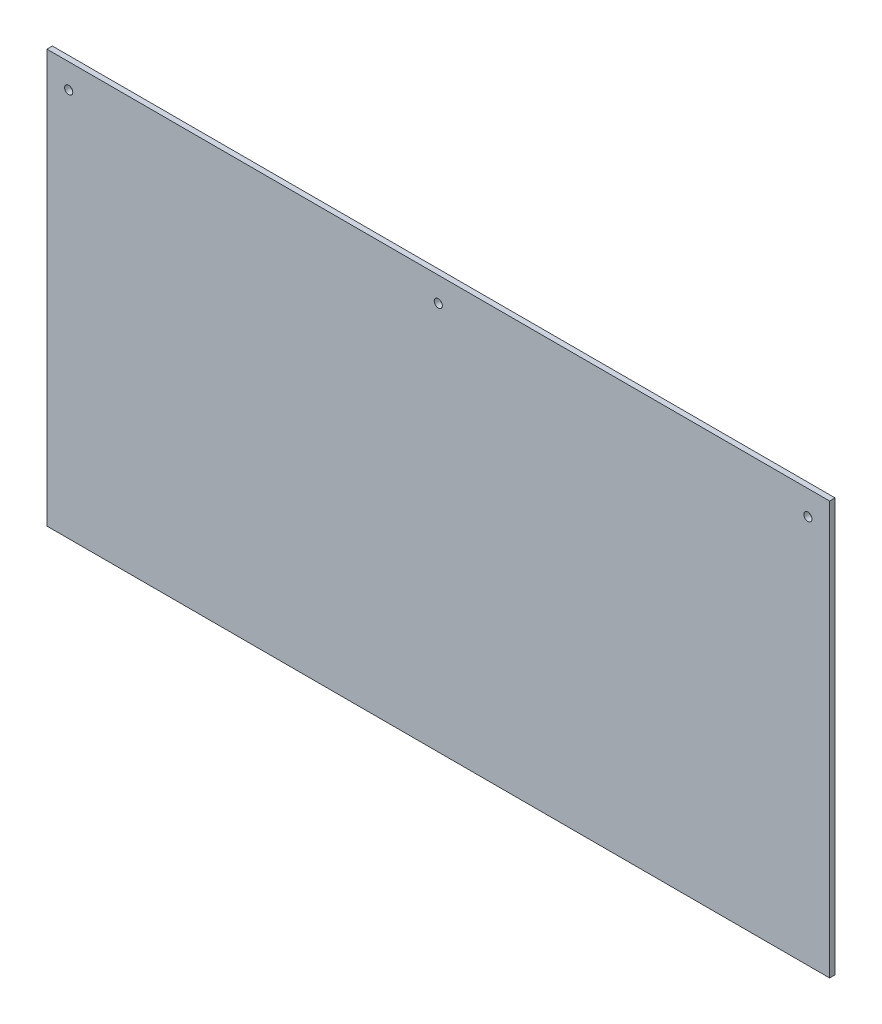
ISO-10303-21;
HEADER;
FILE_DESCRIPTION(('STEP AP214'),'2;1');
FILE_NAME('part.step','',(''),(''),'','','');
FILE_SCHEMA(('AUTOMOTIVE_DESIGN { 1 0 10303 214 1 1 1 1 }'));
ENDSEC;
DATA;
#1=APPLICATION_CONTEXT('core data for automotive mechanical design processes');
#2=APPLICATION_PROTOCOL_DEFINITION('international standard','automotive_design',2000,#1);
#3=PRODUCT_CONTEXT('',#1,'mechanical');
#4=PRODUCT('Part','Part','',(#3));
#5=PRODUCT_RELATED_PRODUCT_CATEGORY('part','',(#4));
#6=PRODUCT_DEFINITION_FORMATION('','',#4);
#7=PRODUCT_DEFINITION_CONTEXT('part definition',#1,'design');
#8=PRODUCT_DEFINITION('design','',#6,#7);
#9=PRODUCT_DEFINITION_SHAPE('','',#8);
#10=(LENGTH_UNIT() NAMED_UNIT(*) SI_UNIT(.MILLI.,.METRE.));
#11=(NAMED_UNIT(*) PLANE_ANGLE_UNIT() SI_UNIT($,.RADIAN.));
#12=(NAMED_UNIT(*) SI_UNIT($,.STERADIAN.) SOLID_ANGLE_UNIT());
#13=UNCERTAINTY_MEASURE_WITH_UNIT(LENGTH_MEASURE(1.E-05),#10,'distance_accuracy_value','');
#14=(GEOMETRIC_REPRESENTATION_CONTEXT(3) GLOBAL_UNCERTAINTY_ASSIGNED_CONTEXT((#13)) GLOBAL_UNIT_ASSIGNED_CONTEXT((#10,
#11,#12)) REPRESENTATION_CONTEXT('',''));
#15=CARTESIAN_POINT('',(0.,0.,0.));
#16=DIRECTION('',(0.,0.,1.));
#17=DIRECTION('',(1.,0.,0.));
#18=AXIS2_PLACEMENT_3D('',#15,#16,#17);
#19=CARTESIAN_POINT('',(0.,0.,6.35));
#20=DIRECTION('',(0.,0.,1.));
#21=DIRECTION('',(1.,0.,0.));
#22=AXIS2_PLACEMENT_3D('',#19,#20,#21);
#23=PLANE('',#22);
#24=CARTESIAN_POINT('',(889.,454.025,6.35));
#25=DIRECTION('',(0.,0.,1.));
#26=DIRECTION('',(1.,0.,0.));
#27=AXIS2_PLACEMENT_3D('',#24,#25,#26);
#28=CIRCLE('',#27,4.7625);
#29=CARTESIAN_POINT('',(893.7625,454.025,6.35));
#30=VERTEX_POINT('',#29);
#31=EDGE_CURVE('E89',#30,#30,#28,.F.);
#32=ORIENTED_EDGE('',*,*,#31,.T.);
#33=EDGE_LOOP('',(#32));
#34=FACE_BOUND('',#33,.T.);
#35=CARTESIAN_POINT('',(457.2,454.025,6.35));
#36=DIRECTION('',(0.,0.,1.));
#37=DIRECTION('',(1.,0.,0.));
#38=AXIS2_PLACEMENT_3D('',#35,#36,#37);
#39=CIRCLE('',#38,4.7625);
#40=CARTESIAN_POINT('',(461.9625,454.025,6.35));
#41=VERTEX_POINT('',#40);
#42=EDGE_CURVE('E91',#41,#41,#39,.F.);
#43=ORIENTED_EDGE('',*,*,#42,.T.);
#44=EDGE_LOOP('',(#43));
#45=FACE_BOUND('',#44,.T.);
#46=CARTESIAN_POINT('',(25.4,454.025,6.35));
#47=DIRECTION('',(0.,0.,1.));
#48=DIRECTION('',(1.,0.,0.));
#49=AXIS2_PLACEMENT_3D('',#46,#47,#48);
#50=CIRCLE('',#49,4.7625);
#51=CARTESIAN_POINT('',(30.1625,454.025,6.35));
#52=VERTEX_POINT('',#51);
#53=EDGE_CURVE('E20',#52,#52,#50,.F.);
#54=ORIENTED_EDGE('',*,*,#53,.T.);
#55=EDGE_LOOP('',(#54));
#56=FACE_BOUND('',#55,.T.);
#57=DIRECTION('',(0.,1.,0.));
#58=VECTOR('',#57,1.);
#59=CARTESIAN_POINT('',(0.,482.6,6.35));
#60=LINE('',#59,#58);
#61=CARTESIAN_POINT('',(0.,0.,6.35));
#62=VERTEX_POINT('',#61);
#63=CARTESIAN_POINT('',(0.,482.6,6.35));
#64=VERTEX_POINT('',#63);
#65=EDGE_CURVE('E71',#62,#64,#60,.T.);
#66=ORIENTED_EDGE('',*,*,#65,.F.);
#67=DIRECTION('',(1.,0.,0.));
#68=VECTOR('',#67,1.);
#69=CARTESIAN_POINT('',(0.,0.,6.35));
#70=LINE('',#69,#68);
#71=CARTESIAN_POINT('',(914.4,0.,6.35));
#72=VERTEX_POINT('',#71);
#73=EDGE_CURVE('E68',#72,#62,#70,.F.);
#74=ORIENTED_EDGE('',*,*,#73,.F.);
#75=DIRECTION('',(0.,1.,0.));
#76=VECTOR('',#75,1.);
#77=CARTESIAN_POINT('',(914.4,0.,6.35));
#78=LINE('',#77,#76);
#79=CARTESIAN_POINT('',(914.4,482.6,6.35));
#80=VERTEX_POINT('',#79);
#81=EDGE_CURVE('E59',#80,#72,#78,.F.);
#82=ORIENTED_EDGE('',*,*,#81,.F.);
#83=DIRECTION('',(1.,0.,0.));
#84=VECTOR('',#83,1.);
#85=CARTESIAN_POINT('',(914.4,482.6,6.35));
#86=LINE('',#85,#84);
#87=EDGE_CURVE('E54',#64,#80,#86,.T.);
#88=ORIENTED_EDGE('',*,*,#87,.F.);
#89=EDGE_LOOP('',(#66,#74,#82,#88));
#90=FACE_BOUND('',#89,.T.);
#91=ADVANCED_FACE('F17',(#34,#45,#56,#90),#23,.T.);
#92=CARTESIAN_POINT('',(0.,0.,0.));
#93=DIRECTION('',(0.,-1.,0.));
#94=DIRECTION('',(0.,0.,-1.));
#95=AXIS2_PLACEMENT_3D('',#92,#93,#94);
#96=PLANE('',#95);
#97=DIRECTION('',(0.,0.,1.));
#98=VECTOR('',#97,1.);
#99=CARTESIAN_POINT('',(0.,0.,0.));
#100=LINE('',#99,#98);
#101=CARTESIAN_POINT('',(0.,0.,0.));
#102=VERTEX_POINT('',#101);
#103=EDGE_CURVE('E99',#102,#62,#100,.T.);
#104=ORIENTED_EDGE('',*,*,#103,.F.);
#105=DIRECTION('',(1.,0.,0.));
#106=VECTOR('',#105,1.);
#107=CARTESIAN_POINT('',(0.,0.,0.));
#108=LINE('',#107,#106);
#109=CARTESIAN_POINT('',(914.4,0.,0.));
#110=VERTEX_POINT('',#109);
#111=EDGE_CURVE('E78',#102,#110,#108,.T.);
#112=ORIENTED_EDGE('',*,*,#111,.T.);
#113=DIRECTION('',(0.,0.,-1.));
#114=VECTOR('',#113,1.);
#115=CARTESIAN_POINT('',(914.4,0.,0.));
#116=LINE('',#115,#114);
#117=EDGE_CURVE('E64',#72,#110,#116,.T.);
#118=ORIENTED_EDGE('',*,*,#117,.F.);
#119=ORIENTED_EDGE('',*,*,#73,.T.);
#120=EDGE_LOOP('',(#104,#112,#118,#119));
#121=FACE_BOUND('',#120,.T.);
#122=ADVANCED_FACE('F77',(#121),#96,.T.);
#123=CARTESIAN_POINT('',(914.4,0.,0.));
#124=DIRECTION('',(1.,0.,0.));
#125=DIRECTION('',(0.,0.,-1.));
#126=AXIS2_PLACEMENT_3D('',#123,#124,#125);
#127=PLANE('',#126);
#128=ORIENTED_EDGE('',*,*,#117,.T.);
#129=DIRECTION('',(0.,1.,0.));
#130=VECTOR('',#129,1.);
#131=CARTESIAN_POINT('',(914.4,0.,0.));
#132=LINE('',#131,#130);
#133=CARTESIAN_POINT('',(914.4,482.6,0.));
#134=VERTEX_POINT('',#133);
#135=EDGE_CURVE('E110',#110,#134,#132,.T.);
#136=ORIENTED_EDGE('',*,*,#135,.T.);
#137=DIRECTION('',(0.,0.,1.));
#138=VECTOR('',#137,1.);
#139=CARTESIAN_POINT('',(914.4,482.6,0.));
#140=LINE('',#139,#138);
#141=EDGE_CURVE('E66',#80,#134,#140,.F.);
#142=ORIENTED_EDGE('',*,*,#141,.F.);
#143=ORIENTED_EDGE('',*,*,#81,.T.);
#144=EDGE_LOOP('',(#128,#136,#142,#143));
#145=FACE_BOUND('',#144,.T.);
#146=ADVANCED_FACE('F61',(#145),#127,.T.);
#147=CARTESIAN_POINT('',(914.4,482.6,0.));
#148=DIRECTION('',(0.,1.,0.));
#149=DIRECTION('',(0.,0.,1.));
#150=AXIS2_PLACEMENT_3D('',#147,#148,#149);
#151=PLANE('',#150);
#152=ORIENTED_EDGE('',*,*,#141,.T.);
#153=DIRECTION('',(1.,0.,0.));
#154=VECTOR('',#153,1.);
#155=CARTESIAN_POINT('',(0.,482.6,0.));
#156=LINE('',#155,#154);
#157=CARTESIAN_POINT('',(0.,482.6,0.));
#158=VERTEX_POINT('',#157);
#159=EDGE_CURVE('E107',#134,#158,#156,.F.);
#160=ORIENTED_EDGE('',*,*,#159,.T.);
#161=DIRECTION('',(0.,0.,1.));
#162=VECTOR('',#161,1.);
#163=CARTESIAN_POINT('',(0.,482.6,0.));
#164=LINE('',#163,#162);
#165=EDGE_CURVE('E35',#64,#158,#164,.F.);
#166=ORIENTED_EDGE('',*,*,#165,.F.);
#167=ORIENTED_EDGE('',*,*,#87,.T.);
#168=EDGE_LOOP('',(#152,#160,#166,#167));
#169=FACE_BOUND('',#168,.T.);
#170=ADVANCED_FACE('F106',(#169),#151,.T.);
#171=CARTESIAN_POINT('',(0.,482.6,0.));
#172=DIRECTION('',(-1.,0.,0.));
#173=DIRECTION('',(0.,0.,1.));
#174=AXIS2_PLACEMENT_3D('',#171,#172,#173);
#175=PLANE('',#174);
#176=ORIENTED_EDGE('',*,*,#165,.T.);
#177=DIRECTION('',(0.,1.,0.));
#178=VECTOR('',#177,1.);
#179=CARTESIAN_POINT('',(0.,0.,0.));
#180=LINE('',#179,#178);
#181=EDGE_CURVE('E88',#158,#102,#180,.F.);
#182=ORIENTED_EDGE('',*,*,#181,.T.);
#183=ORIENTED_EDGE('',*,*,#103,.T.);
#184=ORIENTED_EDGE('',*,*,#65,.T.);
#185=EDGE_LOOP('',(#176,#182,#183,#184));
#186=FACE_BOUND('',#185,.T.);
#187=ADVANCED_FACE('F113',(#186),#175,.T.);
#188=CARTESIAN_POINT('',(25.4,454.025,0.));
#189=DIRECTION('',(0.,0.,1.));
#190=DIRECTION('',(1.,0.,0.));
#191=AXIS2_PLACEMENT_3D('',#188,#189,#190);
#192=CYLINDRICAL_SURFACE('',#191,4.7625);
#193=ORIENTED_EDGE('',*,*,#53,.F.);
#194=EDGE_LOOP('',(#193));
#195=FACE_BOUND('',#194,.T.);
#196=CARTESIAN_POINT('',(25.4,454.025,0.));
#197=DIRECTION('',(0.,0.,1.));
#198=DIRECTION('',(1.,0.,0.));
#199=AXIS2_PLACEMENT_3D('',#196,#197,#198);
#200=CIRCLE('',#199,4.7625);
#201=CARTESIAN_POINT('',(30.1625,454.025,0.));
#202=VERTEX_POINT('',#201);
#203=EDGE_CURVE('E85',#202,#202,#200,.F.);
#204=ORIENTED_EDGE('',*,*,#203,.T.);
#205=EDGE_LOOP('',(#204));
#206=FACE_BOUND('',#205,.T.);
#207=ADVANCED_FACE('F115',(#195,#206),#192,.F.);
#208=CARTESIAN_POINT('',(457.2,454.025,0.));
#209=DIRECTION('',(0.,0.,1.));
#210=DIRECTION('',(1.,0.,0.));
#211=AXIS2_PLACEMENT_3D('',#208,#209,#210);
#212=CYLINDRICAL_SURFACE('',#211,4.7625);
#213=ORIENTED_EDGE('',*,*,#42,.F.);
#214=EDGE_LOOP('',(#213));
#215=FACE_BOUND('',#214,.T.);
#216=CARTESIAN_POINT('',(457.2,454.025,0.));
#217=DIRECTION('',(0.,0.,1.));
#218=DIRECTION('',(1.,0.,0.));
#219=AXIS2_PLACEMENT_3D('',#216,#217,#218);
#220=CIRCLE('',#219,4.7625);
#221=CARTESIAN_POINT('',(461.9625,454.025,0.));
#222=VERTEX_POINT('',#221);
#223=EDGE_CURVE('E26',#222,#222,#220,.F.);
#224=ORIENTED_EDGE('',*,*,#223,.T.);
#225=EDGE_LOOP('',(#224));
#226=FACE_BOUND('',#225,.T.);
#227=ADVANCED_FACE('F122',(#215,#226),#212,.F.);
#228=CARTESIAN_POINT('',(889.,454.025,0.));
#229=DIRECTION('',(0.,0.,1.));
#230=DIRECTION('',(1.,0.,0.));
#231=AXIS2_PLACEMENT_3D('',#228,#229,#230);
#232=CYLINDRICAL_SURFACE('',#231,4.7625);
#233=ORIENTED_EDGE('',*,*,#31,.F.);
#234=EDGE_LOOP('',(#233));
#235=FACE_BOUND('',#234,.T.);
#236=CARTESIAN_POINT('',(889.,454.025,0.));
#237=DIRECTION('',(0.,0.,1.));
#238=DIRECTION('',(1.,0.,0.));
#239=AXIS2_PLACEMENT_3D('',#236,#237,#238);
#240=CIRCLE('',#239,4.7625);
#241=CARTESIAN_POINT('',(893.7625,454.025,0.));
#242=VERTEX_POINT('',#241);
#243=EDGE_CURVE('E11',#242,#242,#240,.F.);
#244=ORIENTED_EDGE('',*,*,#243,.T.);
#245=EDGE_LOOP('',(#244));
#246=FACE_BOUND('',#245,.T.);
#247=ADVANCED_FACE('F127',(#235,#246),#232,.F.);
#248=CARTESIAN_POINT('',(0.,0.,0.));
#249=DIRECTION('',(0.,0.,1.));
#250=DIRECTION('',(1.,0.,0.));
#251=AXIS2_PLACEMENT_3D('',#248,#249,#250);
#252=PLANE('',#251);
#253=ORIENTED_EDGE('',*,*,#243,.F.);
#254=EDGE_LOOP('',(#253));
#255=FACE_BOUND('',#254,.T.);
#256=ORIENTED_EDGE('',*,*,#223,.F.);
#257=EDGE_LOOP('',(#256));
#258=FACE_BOUND('',#257,.T.);
#259=ORIENTED_EDGE('',*,*,#203,.F.);
#260=EDGE_LOOP('',(#259));
#261=FACE_BOUND('',#260,.T.);
#262=ORIENTED_EDGE('',*,*,#159,.F.);
#263=ORIENTED_EDGE('',*,*,#135,.F.);
#264=ORIENTED_EDGE('',*,*,#111,.F.);
#265=ORIENTED_EDGE('',*,*,#181,.F.);
#266=EDGE_LOOP('',(#262,#263,#264,#265));
#267=FACE_BOUND('',#266,.T.);
#268=ADVANCED_FACE('F109',(#255,#258,#261,#267),#252,.F.);
#269=CLOSED_SHELL('',(#91,#122,#146,#170,#187,#207,#227,#247,#268));
#270=MANIFOLD_SOLID_BREP('B1',#269);
#271=ADVANCED_BREP_SHAPE_REPRESENTATION('',(#18,#270),#14);
#272=SHAPE_DEFINITION_REPRESENTATION(#9,#271);
ENDSEC;
END-ISO-10303-21;
